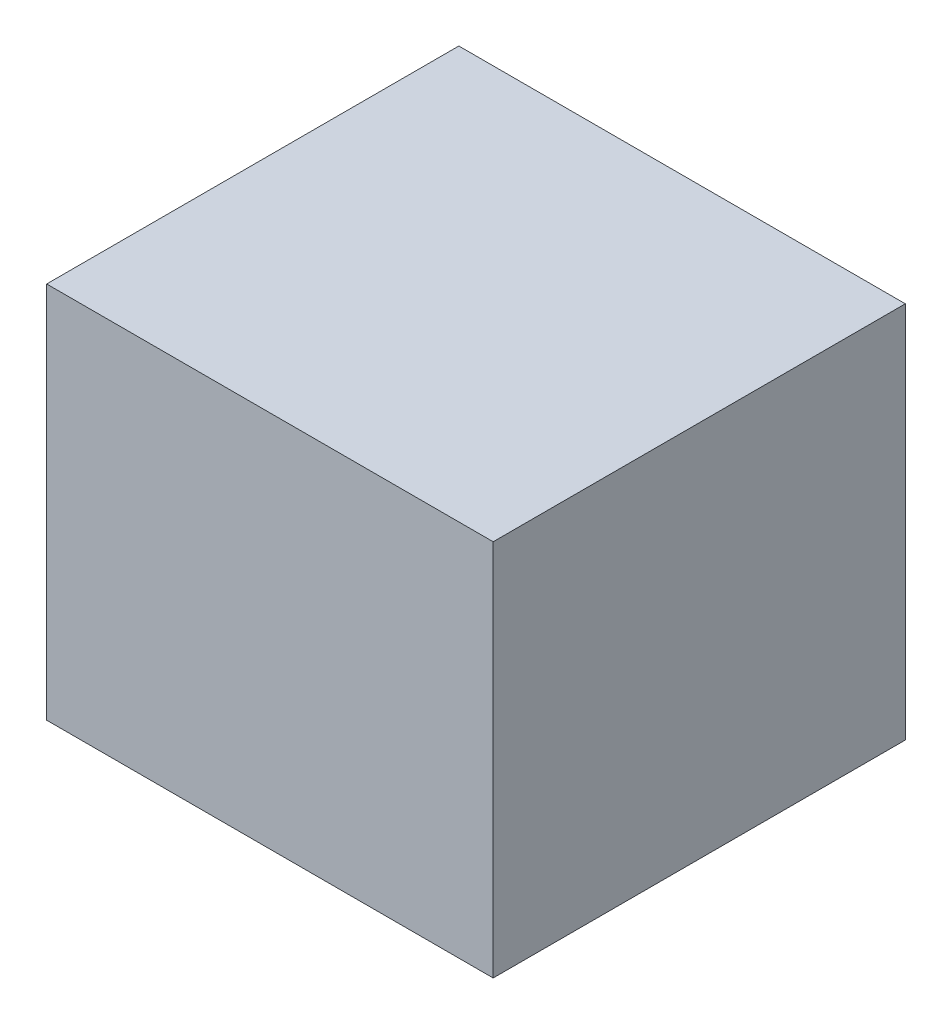
ISO-10303-21;
HEADER;
FILE_DESCRIPTION(('STEP AP214'),'2;1');
FILE_NAME('part.step','',(''),(''),'','','');
FILE_SCHEMA(('AUTOMOTIVE_DESIGN { 1 0 10303 214 1 1 1 1 }'));
ENDSEC;
DATA;
#1=APPLICATION_CONTEXT('core data for automotive mechanical design processes');
#2=APPLICATION_PROTOCOL_DEFINITION('international standard','automotive_design',2000,#1);
#3=PRODUCT_CONTEXT('',#1,'mechanical');
#4=PRODUCT('Part','Part','',(#3));
#5=PRODUCT_RELATED_PRODUCT_CATEGORY('part','',(#4));
#6=PRODUCT_DEFINITION_FORMATION('','',#4);
#7=PRODUCT_DEFINITION_CONTEXT('part definition',#1,'design');
#8=PRODUCT_DEFINITION('design','',#6,#7);
#9=PRODUCT_DEFINITION_SHAPE('','',#8);
#10=(LENGTH_UNIT() NAMED_UNIT(*) SI_UNIT(.MILLI.,.METRE.));
#11=(NAMED_UNIT(*) PLANE_ANGLE_UNIT() SI_UNIT($,.RADIAN.));
#12=(NAMED_UNIT(*) SI_UNIT($,.STERADIAN.) SOLID_ANGLE_UNIT());
#13=UNCERTAINTY_MEASURE_WITH_UNIT(LENGTH_MEASURE(1.E-05),#10,'distance_accuracy_value','');
#14=(GEOMETRIC_REPRESENTATION_CONTEXT(3) GLOBAL_UNCERTAINTY_ASSIGNED_CONTEXT((#13)) GLOBAL_UNIT_ASSIGNED_CONTEXT((#10,
#11,#12)) REPRESENTATION_CONTEXT('',''));
#15=CARTESIAN_POINT('',(0.,0.,0.));
#16=DIRECTION('',(0.,0.,1.));
#17=DIRECTION('',(1.,0.,0.));
#18=AXIS2_PLACEMENT_3D('',#15,#16,#17);
#19=CARTESIAN_POINT('',(-825.5,1397.,-762.));
#20=DIRECTION('',(1.,0.,0.));
#21=DIRECTION('',(0.,0.,-1.));
#22=AXIS2_PLACEMENT_3D('',#19,#20,#21);
#23=PLANE('',#22);
#24=DIRECTION('',(0.,0.,1.));
#25=VECTOR('',#24,1.);
#26=CARTESIAN_POINT('',(-825.5,0.,-762.));
#27=LINE('',#26,#25);
#28=CARTESIAN_POINT('',(-825.5,0.,-762.));
#29=VERTEX_POINT('',#28);
#30=CARTESIAN_POINT('',(-825.5,0.,762.));
#31=VERTEX_POINT('',#30);
#32=EDGE_CURVE('E96',#29,#31,#27,.T.);
#33=ORIENTED_EDGE('',*,*,#32,.T.);
#34=DIRECTION('',(0.,-1.,0.));
#35=VECTOR('',#34,1.);
#36=CARTESIAN_POINT('',(-825.5,1397.,762.));
#37=LINE('',#36,#35);
#38=CARTESIAN_POINT('',(-825.5,1397.,762.));
#39=VERTEX_POINT('',#38);
#40=EDGE_CURVE('E11',#39,#31,#37,.T.);
#41=ORIENTED_EDGE('',*,*,#40,.F.);
#42=DIRECTION('',(0.,0.,1.));
#43=VECTOR('',#42,1.);
#44=CARTESIAN_POINT('',(-825.5,1397.,-762.));
#45=LINE('',#44,#43);
#46=CARTESIAN_POINT('',(-825.5,1397.,-762.));
#47=VERTEX_POINT('',#46);
#48=EDGE_CURVE('E84',#47,#39,#45,.T.);
#49=ORIENTED_EDGE('',*,*,#48,.F.);
#50=DIRECTION('',(0.,-1.,0.));
#51=VECTOR('',#50,1.);
#52=CARTESIAN_POINT('',(-825.5,1397.,-762.));
#53=LINE('',#52,#51);
#54=EDGE_CURVE('E92',#47,#29,#53,.T.);
#55=ORIENTED_EDGE('',*,*,#54,.T.);
#56=EDGE_LOOP('',(#33,#41,#49,#55));
#57=FACE_BOUND('',#56,.T.);
#58=ADVANCED_FACE('F33',(#57),#23,.F.);
#59=CARTESIAN_POINT('',(-825.5,1397.,762.));
#60=DIRECTION('',(0.,0.,-1.));
#61=DIRECTION('',(-1.,0.,0.));
#62=AXIS2_PLACEMENT_3D('',#59,#60,#61);
#63=PLANE('',#62);
#64=DIRECTION('',(1.,0.,0.));
#65=VECTOR('',#64,1.);
#66=CARTESIAN_POINT('',(-825.5,0.,762.));
#67=LINE('',#66,#65);
#68=CARTESIAN_POINT('',(825.5,0.,762.));
#69=VERTEX_POINT('',#68);
#70=EDGE_CURVE('E88',#31,#69,#67,.T.);
#71=ORIENTED_EDGE('',*,*,#70,.T.);
#72=DIRECTION('',(0.,-1.,0.));
#73=VECTOR('',#72,1.);
#74=CARTESIAN_POINT('',(825.5,1397.,762.));
#75=LINE('',#74,#73);
#76=CARTESIAN_POINT('',(825.5,1397.,762.));
#77=VERTEX_POINT('',#76);
#78=EDGE_CURVE('E41',#77,#69,#75,.T.);
#79=ORIENTED_EDGE('',*,*,#78,.F.);
#80=DIRECTION('',(1.,0.,0.));
#81=VECTOR('',#80,1.);
#82=CARTESIAN_POINT('',(-825.5,1397.,762.));
#83=LINE('',#82,#81);
#84=EDGE_CURVE('E79',#39,#77,#83,.T.);
#85=ORIENTED_EDGE('',*,*,#84,.F.);
#86=ORIENTED_EDGE('',*,*,#40,.T.);
#87=EDGE_LOOP('',(#71,#79,#85,#86));
#88=FACE_BOUND('',#87,.T.);
#89=ADVANCED_FACE('F87',(#88),#63,.F.);
#90=CARTESIAN_POINT('',(825.5,1397.,-762.));
#91=DIRECTION('',(-1.,0.,0.));
#92=DIRECTION('',(0.,0.,1.));
#93=AXIS2_PLACEMENT_3D('',#90,#91,#92);
#94=PLANE('',#93);
#95=DIRECTION('',(0.,0.,-1.));
#96=VECTOR('',#95,1.);
#97=CARTESIAN_POINT('',(825.5,0.,-762.));
#98=LINE('',#97,#96);
#99=CARTESIAN_POINT('',(825.5,0.,-762.));
#100=VERTEX_POINT('',#99);
#101=EDGE_CURVE('E66',#69,#100,#98,.T.);
#102=ORIENTED_EDGE('',*,*,#101,.T.);
#103=DIRECTION('',(0.,-1.,0.));
#104=VECTOR('',#103,1.);
#105=CARTESIAN_POINT('',(825.5,1397.,-762.));
#106=LINE('',#105,#104);
#107=CARTESIAN_POINT('',(825.5,1397.,-762.));
#108=VERTEX_POINT('',#107);
#109=EDGE_CURVE('E89',#108,#100,#106,.T.);
#110=ORIENTED_EDGE('',*,*,#109,.F.);
#111=DIRECTION('',(0.,0.,-1.));
#112=VECTOR('',#111,1.);
#113=CARTESIAN_POINT('',(825.5,1397.,-762.));
#114=LINE('',#113,#112);
#115=EDGE_CURVE('E82',#77,#108,#114,.T.);
#116=ORIENTED_EDGE('',*,*,#115,.F.);
#117=ORIENTED_EDGE('',*,*,#78,.T.);
#118=EDGE_LOOP('',(#102,#110,#116,#117));
#119=FACE_BOUND('',#118,.T.);
#120=ADVANCED_FACE('F90',(#119),#94,.F.);
#121=CARTESIAN_POINT('',(-825.5,1397.,-762.));
#122=DIRECTION('',(0.,0.,1.));
#123=DIRECTION('',(1.,0.,0.));
#124=AXIS2_PLACEMENT_3D('',#121,#122,#123);
#125=PLANE('',#124);
#126=DIRECTION('',(-1.,0.,0.));
#127=VECTOR('',#126,1.);
#128=CARTESIAN_POINT('',(-825.5,0.,-762.));
#129=LINE('',#128,#127);
#130=EDGE_CURVE('E72',#100,#29,#129,.T.);
#131=ORIENTED_EDGE('',*,*,#130,.T.);
#132=ORIENTED_EDGE('',*,*,#54,.F.);
#133=DIRECTION('',(-1.,0.,0.));
#134=VECTOR('',#133,1.);
#135=CARTESIAN_POINT('',(-825.5,1397.,-762.));
#136=LINE('',#135,#134);
#137=EDGE_CURVE('E49',#108,#47,#136,.T.);
#138=ORIENTED_EDGE('',*,*,#137,.F.);
#139=ORIENTED_EDGE('',*,*,#109,.T.);
#140=EDGE_LOOP('',(#131,#132,#138,#139));
#141=FACE_BOUND('',#140,.T.);
#142=ADVANCED_FACE('F103',(#141),#125,.F.);
#143=CARTESIAN_POINT('',(0.,1397.,0.));
#144=DIRECTION('',(0.,1.,0.));
#145=DIRECTION('',(0.,0.,1.));
#146=AXIS2_PLACEMENT_3D('',#143,#144,#145);
#147=PLANE('',#146);
#148=ORIENTED_EDGE('',*,*,#48,.T.);
#149=ORIENTED_EDGE('',*,*,#84,.T.);
#150=ORIENTED_EDGE('',*,*,#115,.T.);
#151=ORIENTED_EDGE('',*,*,#137,.T.);
#152=EDGE_LOOP('',(#148,#149,#150,#151));
#153=FACE_BOUND('',#152,.T.);
#154=ADVANCED_FACE('F80',(#153),#147,.T.);
#155=CARTESIAN_POINT('',(0.,0.,0.));
#156=DIRECTION('',(0.,1.,0.));
#157=DIRECTION('',(0.,0.,1.));
#158=AXIS2_PLACEMENT_3D('',#155,#156,#157);
#159=PLANE('',#158);
#160=ORIENTED_EDGE('',*,*,#32,.F.);
#161=ORIENTED_EDGE('',*,*,#130,.F.);
#162=ORIENTED_EDGE('',*,*,#101,.F.);
#163=ORIENTED_EDGE('',*,*,#70,.F.);
#164=EDGE_LOOP('',(#160,#161,#162,#163));
#165=FACE_BOUND('',#164,.T.);
#166=ADVANCED_FACE('F106',(#165),#159,.F.);
#167=CLOSED_SHELL('',(#58,#89,#120,#142,#154,#166));
#168=MANIFOLD_SOLID_BREP('B2',#167);
#169=ADVANCED_BREP_SHAPE_REPRESENTATION('',(#18,#168),#14);
#170=SHAPE_DEFINITION_REPRESENTATION(#9,#169);
ENDSEC;
END-ISO-10303-21;
